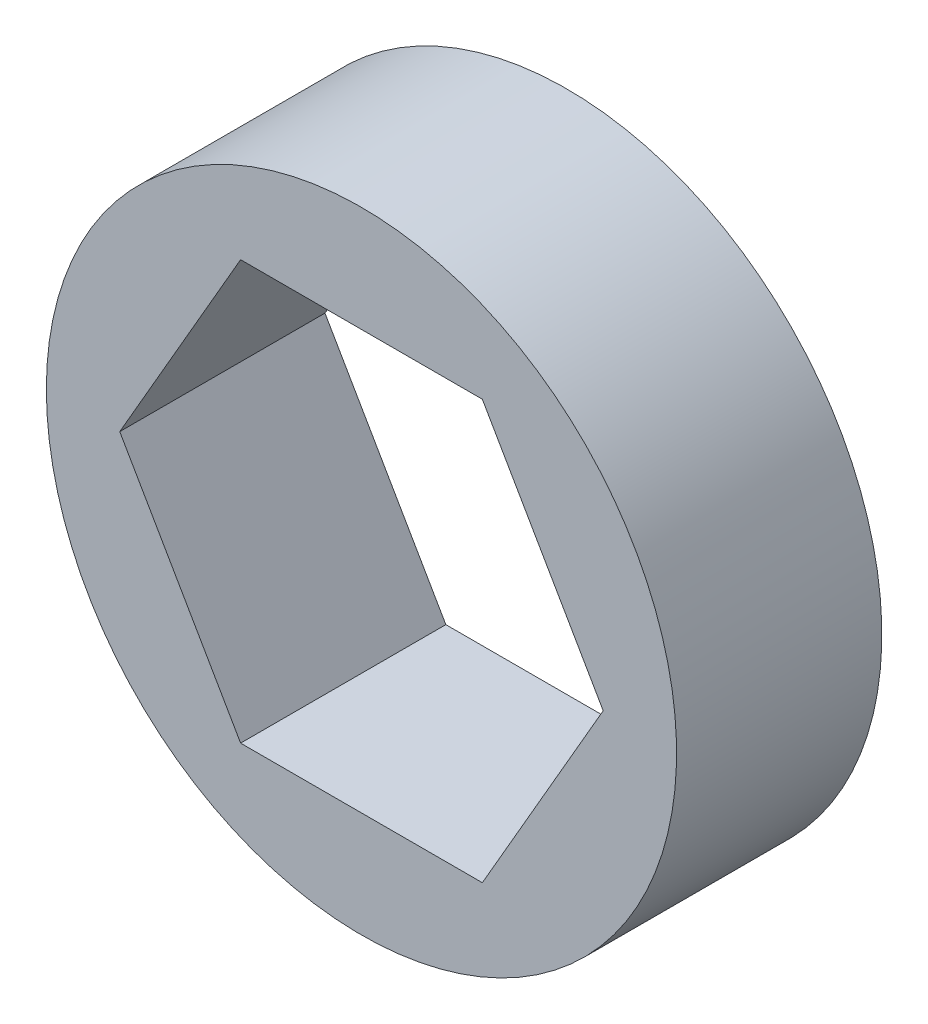
ISO-10303-21;
HEADER;
FILE_DESCRIPTION(('STEP AP214'),'2;1');
FILE_NAME('part.step','',(''),(''),'','','');
FILE_SCHEMA(('AUTOMOTIVE_DESIGN { 1 0 10303 214 1 1 1 1 }'));
ENDSEC;
DATA;
#1=APPLICATION_CONTEXT('core data for automotive mechanical design processes');
#2=APPLICATION_PROTOCOL_DEFINITION('international standard','automotive_design',2000,#1);
#3=PRODUCT_CONTEXT('',#1,'mechanical');
#4=PRODUCT('Part','Part','',(#3));
#5=PRODUCT_RELATED_PRODUCT_CATEGORY('part','',(#4));
#6=PRODUCT_DEFINITION_FORMATION('','',#4);
#7=PRODUCT_DEFINITION_CONTEXT('part definition',#1,'design');
#8=PRODUCT_DEFINITION('design','',#6,#7);
#9=PRODUCT_DEFINITION_SHAPE('','',#8);
#10=(LENGTH_UNIT() NAMED_UNIT(*) SI_UNIT(.MILLI.,.METRE.));
#11=(NAMED_UNIT(*) PLANE_ANGLE_UNIT() SI_UNIT($,.RADIAN.));
#12=(NAMED_UNIT(*) SI_UNIT($,.STERADIAN.) SOLID_ANGLE_UNIT());
#13=UNCERTAINTY_MEASURE_WITH_UNIT(LENGTH_MEASURE(1.E-05),#10,'distance_accuracy_value','');
#14=(GEOMETRIC_REPRESENTATION_CONTEXT(3) GLOBAL_UNCERTAINTY_ASSIGNED_CONTEXT((#13)) GLOBAL_UNIT_ASSIGNED_CONTEXT((#10,
#11,#12)) REPRESENTATION_CONTEXT('',''));
#15=CARTESIAN_POINT('',(0.,0.,0.));
#16=DIRECTION('',(0.,0.,1.));
#17=DIRECTION('',(1.,0.,0.));
#18=AXIS2_PLACEMENT_3D('',#15,#16,#17);
#19=CARTESIAN_POINT('',(-3.73949769354121,-6.477,3.175));
#20=DIRECTION('',(0.,1.,0.));
#21=DIRECTION('',(0.,0.,1.));
#22=AXIS2_PLACEMENT_3D('',#19,#20,#21);
#23=PLANE('',#22);
#24=DIRECTION('',(1.,0.,0.));
#25=VECTOR('',#24,1.);
#26=CARTESIAN_POINT('',(0.,-6.477,-3.175));
#27=LINE('',#26,#25);
#28=CARTESIAN_POINT('',(3.73949769354121,-6.477,-3.175));
#29=VERTEX_POINT('',#28);
#30=CARTESIAN_POINT('',(-3.73949769354121,-6.477,-3.175));
#31=VERTEX_POINT('',#30);
#32=EDGE_CURVE('E116',#29,#31,#27,.F.);
#33=ORIENTED_EDGE('',*,*,#32,.T.);
#34=DIRECTION('',(0.,0.,1.));
#35=VECTOR('',#34,1.);
#36=CARTESIAN_POINT('',(-3.73949769354121,-6.477,3.175));
#37=LINE('',#36,#35);
#38=CARTESIAN_POINT('',(-3.73949769354121,-6.477,3.175));
#39=VERTEX_POINT('',#38);
#40=EDGE_CURVE('E100',#39,#31,#37,.F.);
#41=ORIENTED_EDGE('',*,*,#40,.F.);
#42=DIRECTION('',(1.,0.,0.));
#43=VECTOR('',#42,1.);
#44=CARTESIAN_POINT('',(0.,-6.477,3.175));
#45=LINE('',#44,#43);
#46=CARTESIAN_POINT('',(3.73949769354121,-6.477,3.175));
#47=VERTEX_POINT('',#46);
#48=EDGE_CURVE('E125',#47,#39,#45,.F.);
#49=ORIENTED_EDGE('',*,*,#48,.F.);
#50=DIRECTION('',(0.,0.,1.));
#51=VECTOR('',#50,1.);
#52=CARTESIAN_POINT('',(3.73949769354121,-6.477,3.175));
#53=LINE('',#52,#51);
#54=EDGE_CURVE('E90',#29,#47,#53,.T.);
#55=ORIENTED_EDGE('',*,*,#54,.F.);
#56=EDGE_LOOP('',(#33,#41,#49,#55));
#57=FACE_BOUND('',#56,.T.);
#58=ADVANCED_FACE('F17',(#57),#23,.T.);
#59=CARTESIAN_POINT('',(-7.47899538708241,0.,3.175));
#60=DIRECTION('',(0.866025403784439,0.5,0.));
#61=DIRECTION('',(-0.5,0.866025403784439,0.));
#62=AXIS2_PLACEMENT_3D('',#59,#60,#61);
#63=PLANE('',#62);
#64=DIRECTION('',(-0.5,0.866025403784439,0.));
#65=VECTOR('',#64,1.);
#66=CARTESIAN_POINT('',(-3.73949769354121,-6.477,-3.175));
#67=LINE('',#66,#65);
#68=CARTESIAN_POINT('',(-7.47899538708241,0.,-3.175));
#69=VERTEX_POINT('',#68);
#70=EDGE_CURVE('E106',#31,#69,#67,.T.);
#71=ORIENTED_EDGE('',*,*,#70,.T.);
#72=DIRECTION('',(0.,0.,1.));
#73=VECTOR('',#72,1.);
#74=CARTESIAN_POINT('',(-7.47899538708241,0.,3.175));
#75=LINE('',#74,#73);
#76=CARTESIAN_POINT('',(-7.47899538708241,0.,3.175));
#77=VERTEX_POINT('',#76);
#78=EDGE_CURVE('E97',#77,#69,#75,.F.);
#79=ORIENTED_EDGE('',*,*,#78,.F.);
#80=DIRECTION('',(-0.5,0.866025403784439,0.));
#81=VECTOR('',#80,1.);
#82=CARTESIAN_POINT('',(-3.73949769354121,-6.477,3.175));
#83=LINE('',#82,#81);
#84=EDGE_CURVE('E107',#39,#77,#83,.T.);
#85=ORIENTED_EDGE('',*,*,#84,.F.);
#86=ORIENTED_EDGE('',*,*,#40,.T.);
#87=EDGE_LOOP('',(#71,#79,#85,#86));
#88=FACE_BOUND('',#87,.T.);
#89=ADVANCED_FACE('F105',(#88),#63,.T.);
#90=CARTESIAN_POINT('',(-3.73949769354121,6.477,3.175));
#91=DIRECTION('',(0.866025403784439,-0.5,0.));
#92=DIRECTION('',(0.5,0.866025403784439,0.));
#93=AXIS2_PLACEMENT_3D('',#90,#91,#92);
#94=PLANE('',#93);
#95=DIRECTION('',(0.5,0.866025403784439,0.));
#96=VECTOR('',#95,1.);
#97=CARTESIAN_POINT('',(-7.47899538708241,0.,-3.175));
#98=LINE('',#97,#96);
#99=CARTESIAN_POINT('',(-3.73949769354121,6.477,-3.175));
#100=VERTEX_POINT('',#99);
#101=EDGE_CURVE('E117',#69,#100,#98,.T.);
#102=ORIENTED_EDGE('',*,*,#101,.T.);
#103=DIRECTION('',(0.,0.,1.));
#104=VECTOR('',#103,1.);
#105=CARTESIAN_POINT('',(-3.73949769354121,6.477,3.175));
#106=LINE('',#105,#104);
#107=CARTESIAN_POINT('',(-3.73949769354121,6.477,3.175));
#108=VERTEX_POINT('',#107);
#109=EDGE_CURVE('E65',#108,#100,#106,.F.);
#110=ORIENTED_EDGE('',*,*,#109,.F.);
#111=DIRECTION('',(0.5,0.866025403784439,0.));
#112=VECTOR('',#111,1.);
#113=CARTESIAN_POINT('',(-7.47899538708241,0.,3.175));
#114=LINE('',#113,#112);
#115=EDGE_CURVE('E89',#77,#108,#114,.T.);
#116=ORIENTED_EDGE('',*,*,#115,.F.);
#117=ORIENTED_EDGE('',*,*,#78,.T.);
#118=EDGE_LOOP('',(#102,#110,#116,#117));
#119=FACE_BOUND('',#118,.T.);
#120=ADVANCED_FACE('F135',(#119),#94,.T.);
#121=CARTESIAN_POINT('',(3.7394976935412,6.477,3.175));
#122=DIRECTION('',(0.,-1.,0.));
#123=DIRECTION('',(1.,0.,0.));
#124=AXIS2_PLACEMENT_3D('',#121,#122,#123);
#125=PLANE('',#124);
#126=DIRECTION('',(1.,0.,0.));
#127=VECTOR('',#126,1.);
#128=CARTESIAN_POINT('',(0.,6.477,-3.175));
#129=LINE('',#128,#127);
#130=CARTESIAN_POINT('',(3.7394976935412,6.477,-3.175));
#131=VERTEX_POINT('',#130);
#132=EDGE_CURVE('E76',#100,#131,#129,.T.);
#133=ORIENTED_EDGE('',*,*,#132,.T.);
#134=DIRECTION('',(0.,0.,1.));
#135=VECTOR('',#134,1.);
#136=CARTESIAN_POINT('',(3.7394976935412,6.47700000000001,3.175));
#137=LINE('',#136,#135);
#138=CARTESIAN_POINT('',(3.7394976935412,6.477,3.175));
#139=VERTEX_POINT('',#138);
#140=EDGE_CURVE('E69',#139,#131,#137,.F.);
#141=ORIENTED_EDGE('',*,*,#140,.F.);
#142=DIRECTION('',(1.,0.,0.));
#143=VECTOR('',#142,1.);
#144=CARTESIAN_POINT('',(0.,6.477,3.175));
#145=LINE('',#144,#143);
#146=EDGE_CURVE('E73',#108,#139,#145,.T.);
#147=ORIENTED_EDGE('',*,*,#146,.F.);
#148=ORIENTED_EDGE('',*,*,#109,.T.);
#149=EDGE_LOOP('',(#133,#141,#147,#148));
#150=FACE_BOUND('',#149,.T.);
#151=ADVANCED_FACE('F71',(#150),#125,.T.);
#152=CARTESIAN_POINT('',(7.47899538708241,0.,3.175));
#153=DIRECTION('',(-0.866025403784439,-0.5,0.));
#154=DIRECTION('',(0.5,-0.866025403784439,0.));
#155=AXIS2_PLACEMENT_3D('',#152,#153,#154);
#156=PLANE('',#155);
#157=DIRECTION('',(0.5,-0.866025403784438,0.));
#158=VECTOR('',#157,1.);
#159=CARTESIAN_POINT('',(3.7394976935412,6.477,-3.175));
#160=LINE('',#159,#158);
#161=CARTESIAN_POINT('',(7.47899538708242,0.,-3.175));
#162=VERTEX_POINT('',#161);
#163=EDGE_CURVE('E33',#131,#162,#160,.T.);
#164=ORIENTED_EDGE('',*,*,#163,.T.);
#165=DIRECTION('',(0.,0.,1.));
#166=VECTOR('',#165,1.);
#167=CARTESIAN_POINT('',(7.47899538708242,0.,3.175));
#168=LINE('',#167,#166);
#169=CARTESIAN_POINT('',(7.47899538708242,0.,3.175));
#170=VERTEX_POINT('',#169);
#171=EDGE_CURVE('E77',#170,#162,#168,.F.);
#172=ORIENTED_EDGE('',*,*,#171,.F.);
#173=DIRECTION('',(0.5,-0.866025403784438,0.));
#174=VECTOR('',#173,1.);
#175=CARTESIAN_POINT('',(3.7394976935412,6.477,3.175));
#176=LINE('',#175,#174);
#177=EDGE_CURVE('E80',#139,#170,#176,.T.);
#178=ORIENTED_EDGE('',*,*,#177,.F.);
#179=ORIENTED_EDGE('',*,*,#140,.T.);
#180=EDGE_LOOP('',(#164,#172,#178,#179));
#181=FACE_BOUND('',#180,.T.);
#182=ADVANCED_FACE('F81',(#181),#156,.T.);
#183=CARTESIAN_POINT('',(3.73949769354121,-6.477,3.175));
#184=DIRECTION('',(-0.866025403784439,0.5,0.));
#185=DIRECTION('',(-0.5,-0.866025403784439,0.));
#186=AXIS2_PLACEMENT_3D('',#183,#184,#185);
#187=PLANE('',#186);
#188=DIRECTION('',(-0.5,-0.866025403784439,0.));
#189=VECTOR('',#188,1.);
#190=CARTESIAN_POINT('',(7.47899538708241,0.,-3.175));
#191=LINE('',#190,#189);
#192=EDGE_CURVE('E129',#162,#29,#191,.T.);
#193=ORIENTED_EDGE('',*,*,#192,.T.);
#194=ORIENTED_EDGE('',*,*,#54,.T.);
#195=DIRECTION('',(-0.5,-0.866025403784439,0.));
#196=VECTOR('',#195,1.);
#197=CARTESIAN_POINT('',(7.47899538708242,0.,3.175));
#198=LINE('',#197,#196);
#199=EDGE_CURVE('E85',#170,#47,#198,.T.);
#200=ORIENTED_EDGE('',*,*,#199,.F.);
#201=ORIENTED_EDGE('',*,*,#171,.T.);
#202=EDGE_LOOP('',(#193,#194,#200,#201));
#203=FACE_BOUND('',#202,.T.);
#204=ADVANCED_FACE('F128',(#203),#187,.T.);
#205=CARTESIAN_POINT('',(0.,0.,3.175));
#206=DIRECTION('',(0.,0.,1.));
#207=DIRECTION('',(1.,0.,0.));
#208=AXIS2_PLACEMENT_3D('',#205,#206,#207);
#209=PLANE('',#208);
#210=CARTESIAN_POINT('',(0.,0.,3.175));
#211=DIRECTION('',(0.,0.,-1.));
#212=DIRECTION('',(-1.,0.,0.));
#213=AXIS2_PLACEMENT_3D('',#210,#211,#212);
#214=CIRCLE('',#213,9.75);
#215=CARTESIAN_POINT('',(-9.75,0.,3.175));
#216=VERTEX_POINT('',#215);
#217=EDGE_CURVE('E20',#216,#216,#214,.T.);
#218=ORIENTED_EDGE('',*,*,#217,.F.);
#219=EDGE_LOOP('',(#218));
#220=FACE_BOUND('',#219,.T.);
#221=ORIENTED_EDGE('',*,*,#84,.T.);
#222=ORIENTED_EDGE('',*,*,#115,.T.);
#223=ORIENTED_EDGE('',*,*,#146,.T.);
#224=ORIENTED_EDGE('',*,*,#177,.T.);
#225=ORIENTED_EDGE('',*,*,#199,.T.);
#226=ORIENTED_EDGE('',*,*,#48,.T.);
#227=EDGE_LOOP('',(#221,#222,#223,#224,#225,#226));
#228=FACE_BOUND('',#227,.T.);
#229=ADVANCED_FACE('F88',(#220,#228),#209,.T.);
#230=CARTESIAN_POINT('',(0.,0.,-3.175));
#231=DIRECTION('',(0.,0.,1.));
#232=DIRECTION('',(1.,0.,0.));
#233=AXIS2_PLACEMENT_3D('',#230,#231,#232);
#234=PLANE('',#233);
#235=CARTESIAN_POINT('',(0.,0.,-3.175));
#236=DIRECTION('',(0.,0.,-1.));
#237=DIRECTION('',(-1.,0.,0.));
#238=AXIS2_PLACEMENT_3D('',#235,#236,#237);
#239=CIRCLE('',#238,9.75);
#240=CARTESIAN_POINT('',(-9.75,0.,-3.175));
#241=VERTEX_POINT('',#240);
#242=EDGE_CURVE('E11',#241,#241,#239,.F.);
#243=ORIENTED_EDGE('',*,*,#242,.F.);
#244=EDGE_LOOP('',(#243));
#245=FACE_BOUND('',#244,.T.);
#246=ORIENTED_EDGE('',*,*,#163,.F.);
#247=ORIENTED_EDGE('',*,*,#132,.F.);
#248=ORIENTED_EDGE('',*,*,#101,.F.);
#249=ORIENTED_EDGE('',*,*,#70,.F.);
#250=ORIENTED_EDGE('',*,*,#32,.F.);
#251=ORIENTED_EDGE('',*,*,#192,.F.);
#252=EDGE_LOOP('',(#246,#247,#248,#249,#250,#251));
#253=FACE_BOUND('',#252,.T.);
#254=ADVANCED_FACE('F114',(#245,#253),#234,.F.);
#255=CARTESIAN_POINT('',(0.,0.,3.175));
#256=DIRECTION('',(0.,0.,-1.));
#257=DIRECTION('',(-1.,0.,0.));
#258=AXIS2_PLACEMENT_3D('',#255,#256,#257);
#259=CYLINDRICAL_SURFACE('',#258,9.75);
#260=ORIENTED_EDGE('',*,*,#242,.T.);
#261=EDGE_LOOP('',(#260));
#262=FACE_BOUND('',#261,.T.);
#263=ORIENTED_EDGE('',*,*,#217,.T.);
#264=EDGE_LOOP('',(#263));
#265=FACE_BOUND('',#264,.T.);
#266=ADVANCED_FACE('F136',(#262,#265),#259,.T.);
#267=CLOSED_SHELL('',(#58,#89,#120,#151,#182,#204,#229,#254,#266));
#268=MANIFOLD_SOLID_BREP('B1',#267);
#269=ADVANCED_BREP_SHAPE_REPRESENTATION('',(#18,#268),#14);
#270=SHAPE_DEFINITION_REPRESENTATION(#9,#269);
ENDSEC;
END-ISO-10303-21;
